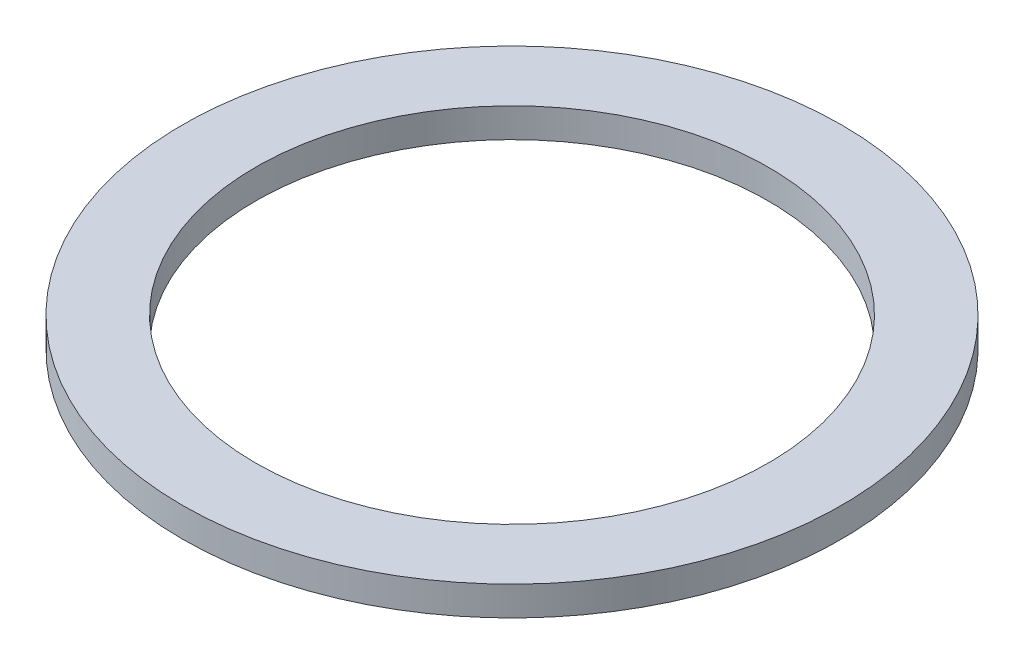
ISO-10303-21;
HEADER;
FILE_DESCRIPTION(('STEP AP214'),'2;1');
FILE_NAME('part.step','',(''),(''),'','','');
FILE_SCHEMA(('AUTOMOTIVE_DESIGN { 1 0 10303 214 1 1 1 1 }'));
ENDSEC;
DATA;
#1=APPLICATION_CONTEXT('core data for automotive mechanical design processes');
#2=APPLICATION_PROTOCOL_DEFINITION('international standard','automotive_design',2000,#1);
#3=PRODUCT_CONTEXT('',#1,'mechanical');
#4=PRODUCT('Part','Part','',(#3));
#5=PRODUCT_RELATED_PRODUCT_CATEGORY('part','',(#4));
#6=PRODUCT_DEFINITION_FORMATION('','',#4);
#7=PRODUCT_DEFINITION_CONTEXT('part definition',#1,'design');
#8=PRODUCT_DEFINITION('design','',#6,#7);
#9=PRODUCT_DEFINITION_SHAPE('','',#8);
#10=(LENGTH_UNIT() NAMED_UNIT(*) SI_UNIT(.MILLI.,.METRE.));
#11=(NAMED_UNIT(*) PLANE_ANGLE_UNIT() SI_UNIT($,.RADIAN.));
#12=(NAMED_UNIT(*) SI_UNIT($,.STERADIAN.) SOLID_ANGLE_UNIT());
#13=UNCERTAINTY_MEASURE_WITH_UNIT(LENGTH_MEASURE(1.E-05),#10,'distance_accuracy_value','');
#14=(GEOMETRIC_REPRESENTATION_CONTEXT(3) GLOBAL_UNCERTAINTY_ASSIGNED_CONTEXT((#13)) GLOBAL_UNIT_ASSIGNED_CONTEXT((#10,
#11,#12)) REPRESENTATION_CONTEXT('',''));
#15=CARTESIAN_POINT('',(0.,0.,0.));
#16=DIRECTION('',(0.,0.,1.));
#17=DIRECTION('',(1.,0.,0.));
#18=AXIS2_PLACEMENT_3D('',#15,#16,#17);
#19=CARTESIAN_POINT('',(0.,4.,0.));
#20=DIRECTION('',(0.,1.,0.));
#21=DIRECTION('',(0.,0.,1.));
#22=AXIS2_PLACEMENT_3D('',#19,#20,#21);
#23=PLANE('',#22);
#24=CARTESIAN_POINT('',(0.,4.,0.));
#25=DIRECTION('',(0.,1.,0.));
#26=DIRECTION('',(0.,0.,1.));
#27=AXIS2_PLACEMENT_3D('',#24,#25,#26);
#28=CIRCLE('',#27,45.);
#29=CARTESIAN_POINT('',(0.,4.,45.));
#30=VERTEX_POINT('',#29);
#31=EDGE_CURVE('E10',#30,#30,#28,.T.);
#32=ORIENTED_EDGE('',*,*,#31,.T.);
#33=EDGE_LOOP('',(#32));
#34=FACE_BOUND('',#33,.T.);
#35=CARTESIAN_POINT('',(0.,4.,0.));
#36=DIRECTION('',(0.,1.,0.));
#37=DIRECTION('',(0.,0.,1.));
#38=AXIS2_PLACEMENT_3D('',#35,#36,#37);
#39=CIRCLE('',#38,35.);
#40=CARTESIAN_POINT('',(0.,4.,35.));
#41=VERTEX_POINT('',#40);
#42=EDGE_CURVE('E43',#41,#41,#39,.T.);
#43=ORIENTED_EDGE('',*,*,#42,.F.);
#44=EDGE_LOOP('',(#43));
#45=FACE_BOUND('',#44,.T.);
#46=ADVANCED_FACE('F32',(#34,#45),#23,.T.);
#47=CARTESIAN_POINT('',(0.,0.,0.));
#48=DIRECTION('',(0.,1.,0.));
#49=DIRECTION('',(0.,0.,1.));
#50=AXIS2_PLACEMENT_3D('',#47,#48,#49);
#51=PLANE('',#50);
#52=CARTESIAN_POINT('',(0.,0.,0.));
#53=DIRECTION('',(0.,1.,0.));
#54=DIRECTION('',(0.,0.,1.));
#55=AXIS2_PLACEMENT_3D('',#52,#53,#54);
#56=CIRCLE('',#55,45.);
#57=CARTESIAN_POINT('',(0.,0.,45.));
#58=VERTEX_POINT('',#57);
#59=EDGE_CURVE('E36',#58,#58,#56,.T.);
#60=ORIENTED_EDGE('',*,*,#59,.F.);
#61=EDGE_LOOP('',(#60));
#62=FACE_BOUND('',#61,.T.);
#63=CARTESIAN_POINT('',(0.,0.,0.));
#64=DIRECTION('',(0.,1.,0.));
#65=DIRECTION('',(0.,0.,1.));
#66=AXIS2_PLACEMENT_3D('',#63,#64,#65);
#67=CIRCLE('',#66,35.);
#68=CARTESIAN_POINT('',(0.,0.,35.));
#69=VERTEX_POINT('',#68);
#70=EDGE_CURVE('E45',#69,#69,#67,.T.);
#71=ORIENTED_EDGE('',*,*,#70,.T.);
#72=EDGE_LOOP('',(#71));
#73=FACE_BOUND('',#72,.T.);
#74=ADVANCED_FACE('F55',(#62,#73),#51,.F.);
#75=CARTESIAN_POINT('',(0.,4.,0.));
#76=DIRECTION('',(0.,-1.,0.));
#77=DIRECTION('',(0.,0.,-1.));
#78=AXIS2_PLACEMENT_3D('',#75,#76,#77);
#79=CYLINDRICAL_SURFACE('',#78,45.);
#80=ORIENTED_EDGE('',*,*,#31,.F.);
#81=EDGE_LOOP('',(#80));
#82=FACE_BOUND('',#81,.T.);
#83=ORIENTED_EDGE('',*,*,#59,.T.);
#84=EDGE_LOOP('',(#83));
#85=FACE_BOUND('',#84,.T.);
#86=ADVANCED_FACE('F34',(#82,#85),#79,.T.);
#87=CARTESIAN_POINT('',(0.,4.,0.));
#88=DIRECTION('',(0.,-1.,0.));
#89=DIRECTION('',(0.,0.,-1.));
#90=AXIS2_PLACEMENT_3D('',#87,#88,#89);
#91=CYLINDRICAL_SURFACE('',#90,35.);
#92=ORIENTED_EDGE('',*,*,#42,.T.);
#93=EDGE_LOOP('',(#92));
#94=FACE_BOUND('',#93,.T.);
#95=ORIENTED_EDGE('',*,*,#70,.F.);
#96=EDGE_LOOP('',(#95));
#97=FACE_BOUND('',#96,.T.);
#98=ADVANCED_FACE('F51',(#94,#97),#91,.F.);
#99=CLOSED_SHELL('',(#46,#74,#86,#98));
#100=MANIFOLD_SOLID_BREP('B2',#99);
#101=ADVANCED_BREP_SHAPE_REPRESENTATION('',(#18,#100),#14);
#102=SHAPE_DEFINITION_REPRESENTATION(#9,#101);
ENDSEC;
END-ISO-10303-21;
